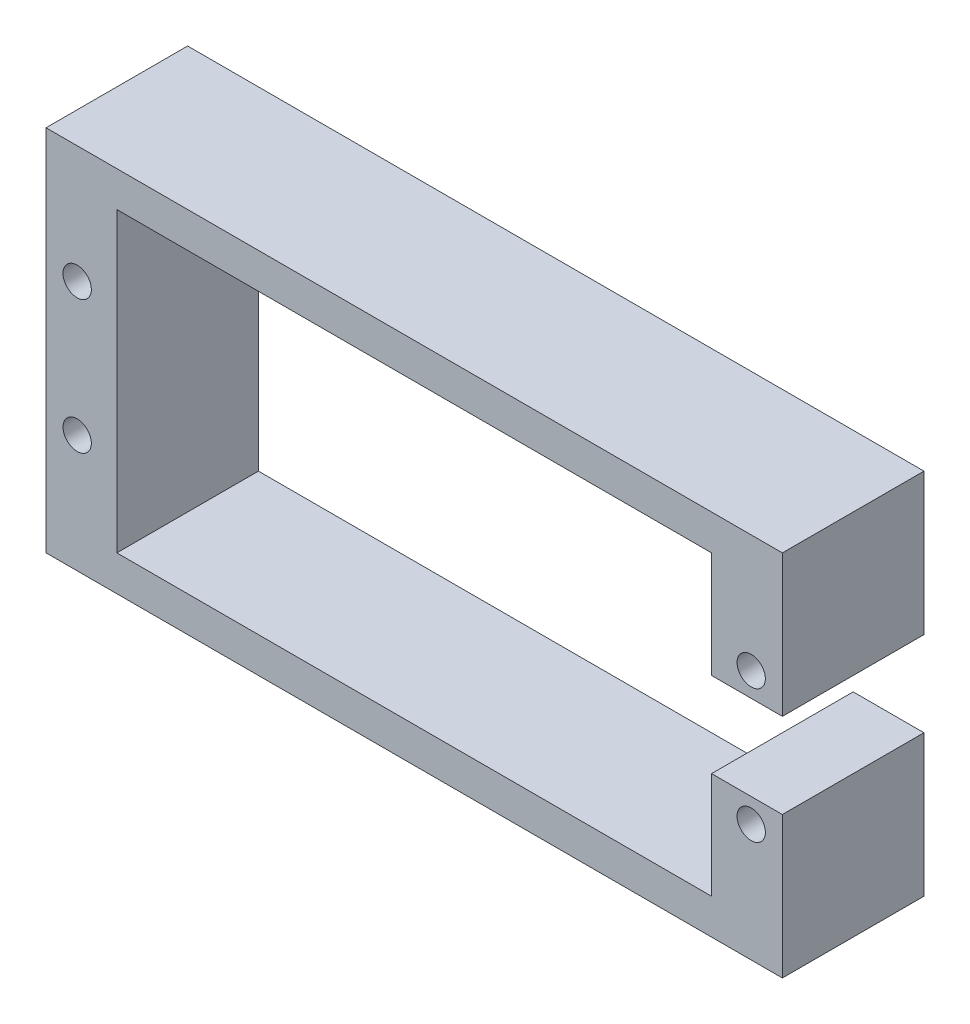
ISO-10303-21;
HEADER;
FILE_DESCRIPTION(('STEP AP214'),'2;1');
FILE_NAME('part.step','',(''),(''),'','','');
FILE_SCHEMA(('AUTOMOTIVE_DESIGN { 1 0 10303 214 1 1 1 1 }'));
ENDSEC;
DATA;
#1=APPLICATION_CONTEXT('core data for automotive mechanical design processes');
#2=APPLICATION_PROTOCOL_DEFINITION('international standard','automotive_design',2000,#1);
#3=PRODUCT_CONTEXT('',#1,'mechanical');
#4=PRODUCT('Part','Part','',(#3));
#5=PRODUCT_RELATED_PRODUCT_CATEGORY('part','',(#4));
#6=PRODUCT_DEFINITION_FORMATION('','',#4);
#7=PRODUCT_DEFINITION_CONTEXT('part definition',#1,'design');
#8=PRODUCT_DEFINITION('design','',#6,#7);
#9=PRODUCT_DEFINITION_SHAPE('','',#8);
#10=(LENGTH_UNIT() NAMED_UNIT(*) SI_UNIT(.MILLI.,.METRE.));
#11=(NAMED_UNIT(*) PLANE_ANGLE_UNIT() SI_UNIT($,.RADIAN.));
#12=(NAMED_UNIT(*) SI_UNIT($,.STERADIAN.) SOLID_ANGLE_UNIT());
#13=UNCERTAINTY_MEASURE_WITH_UNIT(LENGTH_MEASURE(1.E-05),#10,'distance_accuracy_value','');
#14=(GEOMETRIC_REPRESENTATION_CONTEXT(3) GLOBAL_UNCERTAINTY_ASSIGNED_CONTEXT((#13)) GLOBAL_UNIT_ASSIGNED_CONTEXT((#10,
#11,#12)) REPRESENTATION_CONTEXT('',''));
#15=CARTESIAN_POINT('',(0.,0.,0.));
#16=DIRECTION('',(0.,0.,1.));
#17=DIRECTION('',(1.,0.,0.));
#18=AXIS2_PLACEMENT_3D('',#15,#16,#17);
#19=CARTESIAN_POINT('',(0.,0.,10.));
#20=DIRECTION('',(0.,0.,1.));
#21=DIRECTION('',(1.,0.,0.));
#22=AXIS2_PLACEMENT_3D('',#19,#20,#21);
#23=PLANE('',#22);
#24=CARTESIAN_POINT('',(23.8,-4.7,10.));
#25=DIRECTION('',(0.,0.,1.));
#26=DIRECTION('',(1.,0.,0.));
#27=AXIS2_PLACEMENT_3D('',#24,#25,#26);
#28=CIRCLE('',#27,1.);
#29=CARTESIAN_POINT('',(24.8,-4.7,10.));
#30=VERTEX_POINT('',#29);
#31=EDGE_CURVE('E332',#30,#30,#28,.T.);
#32=ORIENTED_EDGE('',*,*,#31,.F.);
#33=EDGE_LOOP('',(#32));
#34=FACE_BOUND('',#33,.T.);
#35=CARTESIAN_POINT('',(-23.8,4.7,10.));
#36=DIRECTION('',(0.,0.,1.));
#37=DIRECTION('',(1.,0.,0.));
#38=AXIS2_PLACEMENT_3D('',#35,#36,#37);
#39=CIRCLE('',#38,1.);
#40=CARTESIAN_POINT('',(-22.8,4.7,10.));
#41=VERTEX_POINT('',#40);
#42=EDGE_CURVE('E170',#41,#41,#39,.T.);
#43=ORIENTED_EDGE('',*,*,#42,.F.);
#44=EDGE_LOOP('',(#43));
#45=FACE_BOUND('',#44,.T.);
#46=DIRECTION('',(0.,1.,0.));
#47=VECTOR('',#46,1.);
#48=CARTESIAN_POINT('',(-21.,10.5,10.));
#49=LINE('',#48,#47);
#50=CARTESIAN_POINT('',(-21.,-10.5,10.));
#51=VERTEX_POINT('',#50);
#52=CARTESIAN_POINT('',(-21.,10.5,10.));
#53=VERTEX_POINT('',#52);
#54=EDGE_CURVE('E200',#51,#53,#49,.T.);
#55=ORIENTED_EDGE('',*,*,#54,.T.);
#56=DIRECTION('',(1.,0.,0.));
#57=VECTOR('',#56,1.);
#58=CARTESIAN_POINT('',(-21.,10.5,10.));
#59=LINE('',#58,#57);
#60=CARTESIAN_POINT('',(21.,10.5,10.));
#61=VERTEX_POINT('',#60);
#62=EDGE_CURVE('E112',#53,#61,#59,.T.);
#63=ORIENTED_EDGE('',*,*,#62,.T.);
#64=DIRECTION('',(0.,-1.,0.));
#65=VECTOR('',#64,1.);
#66=CARTESIAN_POINT('',(21.,10.5,10.));
#67=LINE('',#66,#65);
#68=CARTESIAN_POINT('',(21.,3.,10.));
#69=VERTEX_POINT('',#68);
#70=EDGE_CURVE('E237',#61,#69,#67,.T.);
#71=ORIENTED_EDGE('',*,*,#70,.T.);
#72=DIRECTION('',(1.,0.,0.));
#73=VECTOR('',#72,1.);
#74=CARTESIAN_POINT('',(21.,3.,10.));
#75=LINE('',#74,#73);
#76=CARTESIAN_POINT('',(26.,3.,10.));
#77=VERTEX_POINT('',#76);
#78=EDGE_CURVE('E257',#69,#77,#75,.T.);
#79=ORIENTED_EDGE('',*,*,#78,.T.);
#80=DIRECTION('',(0.,1.,0.));
#81=VECTOR('',#80,1.);
#82=CARTESIAN_POINT('',(26.,13.,10.));
#83=LINE('',#82,#81);
#84=CARTESIAN_POINT('',(26.,13.,10.));
#85=VERTEX_POINT('',#84);
#86=EDGE_CURVE('E253',#77,#85,#83,.T.);
#87=ORIENTED_EDGE('',*,*,#86,.T.);
#88=DIRECTION('',(-1.,0.,0.));
#89=VECTOR('',#88,1.);
#90=CARTESIAN_POINT('',(-26.,13.,10.));
#91=LINE('',#90,#89);
#92=CARTESIAN_POINT('',(-26.,13.,10.));
#93=VERTEX_POINT('',#92);
#94=EDGE_CURVE('E256',#85,#93,#91,.T.);
#95=ORIENTED_EDGE('',*,*,#94,.T.);
#96=DIRECTION('',(0.,-1.,0.));
#97=VECTOR('',#96,1.);
#98=CARTESIAN_POINT('',(-26.,13.,10.));
#99=LINE('',#98,#97);
#100=CARTESIAN_POINT('',(-26.,-13.,10.));
#101=VERTEX_POINT('',#100);
#102=EDGE_CURVE('E261',#93,#101,#99,.T.);
#103=ORIENTED_EDGE('',*,*,#102,.T.);
#104=DIRECTION('',(1.,0.,0.));
#105=VECTOR('',#104,1.);
#106=CARTESIAN_POINT('',(-26.,-13.,10.));
#107=LINE('',#106,#105);
#108=CARTESIAN_POINT('',(26.,-13.,10.));
#109=VERTEX_POINT('',#108);
#110=EDGE_CURVE('E268',#101,#109,#107,.T.);
#111=ORIENTED_EDGE('',*,*,#110,.T.);
#112=DIRECTION('',(0.,1.,0.));
#113=VECTOR('',#112,1.);
#114=CARTESIAN_POINT('',(26.,-3.,10.));
#115=LINE('',#114,#113);
#116=CARTESIAN_POINT('',(26.,-3.,10.));
#117=VERTEX_POINT('',#116);
#118=EDGE_CURVE('E143',#109,#117,#115,.T.);
#119=ORIENTED_EDGE('',*,*,#118,.T.);
#120=DIRECTION('',(-1.,0.,0.));
#121=VECTOR('',#120,1.);
#122=CARTESIAN_POINT('',(21.,-3.,10.));
#123=LINE('',#122,#121);
#124=CARTESIAN_POINT('',(21.,-3.,10.));
#125=VERTEX_POINT('',#124);
#126=EDGE_CURVE('E137',#117,#125,#123,.T.);
#127=ORIENTED_EDGE('',*,*,#126,.T.);
#128=DIRECTION('',(0.,-1.,0.));
#129=VECTOR('',#128,1.);
#130=CARTESIAN_POINT('',(21.,-3.,10.));
#131=LINE('',#130,#129);
#132=CARTESIAN_POINT('',(21.,-10.5,10.));
#133=VERTEX_POINT('',#132);
#134=EDGE_CURVE('E141',#125,#133,#131,.T.);
#135=ORIENTED_EDGE('',*,*,#134,.T.);
#136=DIRECTION('',(-1.,0.,0.));
#137=VECTOR('',#136,1.);
#138=CARTESIAN_POINT('',(-21.,-10.5,10.));
#139=LINE('',#138,#137);
#140=EDGE_CURVE('E57',#133,#51,#139,.T.);
#141=ORIENTED_EDGE('',*,*,#140,.T.);
#142=EDGE_LOOP('',(#55,#63,#71,#79,#87,#95,#103,#111,#119,#127,#135,#141));
#143=FACE_BOUND('',#142,.T.);
#144=CARTESIAN_POINT('',(23.8,4.7,10.));
#145=DIRECTION('',(0.,0.,1.));
#146=DIRECTION('',(-1.,0.,0.));
#147=AXIS2_PLACEMENT_3D('',#144,#145,#146);
#148=CIRCLE('',#147,1.);
#149=CARTESIAN_POINT('',(22.8,4.7,10.));
#150=VERTEX_POINT('',#149);
#151=EDGE_CURVE('E340',#150,#150,#148,.T.);
#152=ORIENTED_EDGE('',*,*,#151,.F.);
#153=EDGE_LOOP('',(#152));
#154=FACE_BOUND('',#153,.T.);
#155=CARTESIAN_POINT('',(-23.8,-4.7,10.));
#156=DIRECTION('',(0.,0.,1.));
#157=DIRECTION('',(-1.,0.,0.));
#158=AXIS2_PLACEMENT_3D('',#155,#156,#157);
#159=CIRCLE('',#158,1.);
#160=CARTESIAN_POINT('',(-24.8,-4.7,10.));
#161=VERTEX_POINT('',#160);
#162=EDGE_CURVE('E321',#161,#161,#159,.T.);
#163=ORIENTED_EDGE('',*,*,#162,.F.);
#164=EDGE_LOOP('',(#163));
#165=FACE_BOUND('',#164,.T.);
#166=ADVANCED_FACE('F39',(#34,#45,#143,#154,#165),#23,.T.);
#167=CARTESIAN_POINT('',(0.,0.,0.));
#168=DIRECTION('',(0.,0.,1.));
#169=DIRECTION('',(1.,0.,0.));
#170=AXIS2_PLACEMENT_3D('',#167,#168,#169);
#171=PLANE('',#170);
#172=DIRECTION('',(0.,1.,0.));
#173=VECTOR('',#172,1.);
#174=CARTESIAN_POINT('',(-21.,10.5,0.));
#175=LINE('',#174,#173);
#176=CARTESIAN_POINT('',(-21.,-10.5,0.));
#177=VERTEX_POINT('',#176);
#178=CARTESIAN_POINT('',(-21.,10.5,0.));
#179=VERTEX_POINT('',#178);
#180=EDGE_CURVE('E165',#177,#179,#175,.T.);
#181=ORIENTED_EDGE('',*,*,#180,.F.);
#182=DIRECTION('',(-1.,0.,0.));
#183=VECTOR('',#182,1.);
#184=CARTESIAN_POINT('',(-21.,-10.5,0.));
#185=LINE('',#184,#183);
#186=CARTESIAN_POINT('',(21.,-10.5,0.));
#187=VERTEX_POINT('',#186);
#188=EDGE_CURVE('E104',#187,#177,#185,.T.);
#189=ORIENTED_EDGE('',*,*,#188,.F.);
#190=DIRECTION('',(0.,-1.,0.));
#191=VECTOR('',#190,1.);
#192=CARTESIAN_POINT('',(21.,-3.,0.));
#193=LINE('',#192,#191);
#194=CARTESIAN_POINT('',(21.,-3.,0.));
#195=VERTEX_POINT('',#194);
#196=EDGE_CURVE('E98',#195,#187,#193,.T.);
#197=ORIENTED_EDGE('',*,*,#196,.F.);
#198=DIRECTION('',(-1.,0.,0.));
#199=VECTOR('',#198,1.);
#200=CARTESIAN_POINT('',(21.,-3.,0.));
#201=LINE('',#200,#199);
#202=CARTESIAN_POINT('',(26.,-3.,0.));
#203=VERTEX_POINT('',#202);
#204=EDGE_CURVE('E152',#203,#195,#201,.T.);
#205=ORIENTED_EDGE('',*,*,#204,.F.);
#206=DIRECTION('',(0.,1.,0.));
#207=VECTOR('',#206,1.);
#208=CARTESIAN_POINT('',(26.,-3.,0.));
#209=LINE('',#208,#207);
#210=CARTESIAN_POINT('',(26.,-13.,0.));
#211=VERTEX_POINT('',#210);
#212=EDGE_CURVE('E191',#211,#203,#209,.T.);
#213=ORIENTED_EDGE('',*,*,#212,.F.);
#214=DIRECTION('',(1.,0.,0.));
#215=VECTOR('',#214,1.);
#216=CARTESIAN_POINT('',(-26.,-13.,0.));
#217=LINE('',#216,#215);
#218=CARTESIAN_POINT('',(-26.,-13.,0.));
#219=VERTEX_POINT('',#218);
#220=EDGE_CURVE('E188',#219,#211,#217,.T.);
#221=ORIENTED_EDGE('',*,*,#220,.F.);
#222=DIRECTION('',(0.,-1.,0.));
#223=VECTOR('',#222,1.);
#224=CARTESIAN_POINT('',(-26.,13.,0.));
#225=LINE('',#224,#223);
#226=CARTESIAN_POINT('',(-26.,13.,0.));
#227=VERTEX_POINT('',#226);
#228=EDGE_CURVE('E185',#227,#219,#225,.T.);
#229=ORIENTED_EDGE('',*,*,#228,.F.);
#230=DIRECTION('',(-1.,0.,0.));
#231=VECTOR('',#230,1.);
#232=CARTESIAN_POINT('',(-26.,13.,0.));
#233=LINE('',#232,#231);
#234=CARTESIAN_POINT('',(26.,13.,0.));
#235=VERTEX_POINT('',#234);
#236=EDGE_CURVE('E182',#235,#227,#233,.T.);
#237=ORIENTED_EDGE('',*,*,#236,.F.);
#238=DIRECTION('',(0.,1.,0.));
#239=VECTOR('',#238,1.);
#240=CARTESIAN_POINT('',(26.,13.,0.));
#241=LINE('',#240,#239);
#242=CARTESIAN_POINT('',(26.,3.,0.));
#243=VERTEX_POINT('',#242);
#244=EDGE_CURVE('E179',#243,#235,#241,.T.);
#245=ORIENTED_EDGE('',*,*,#244,.F.);
#246=DIRECTION('',(1.,0.,0.));
#247=VECTOR('',#246,1.);
#248=CARTESIAN_POINT('',(21.,3.,0.));
#249=LINE('',#248,#247);
#250=CARTESIAN_POINT('',(21.,3.,0.));
#251=VERTEX_POINT('',#250);
#252=EDGE_CURVE('E176',#251,#243,#249,.T.);
#253=ORIENTED_EDGE('',*,*,#252,.F.);
#254=DIRECTION('',(0.,-1.,0.));
#255=VECTOR('',#254,1.);
#256=CARTESIAN_POINT('',(21.,10.5,0.));
#257=LINE('',#256,#255);
#258=CARTESIAN_POINT('',(21.,10.5,0.));
#259=VERTEX_POINT('',#258);
#260=EDGE_CURVE('E173',#259,#251,#257,.T.);
#261=ORIENTED_EDGE('',*,*,#260,.F.);
#262=DIRECTION('',(1.,0.,0.));
#263=VECTOR('',#262,1.);
#264=CARTESIAN_POINT('',(-21.,10.5,0.));
#265=LINE('',#264,#263);
#266=EDGE_CURVE('E169',#179,#259,#265,.T.);
#267=ORIENTED_EDGE('',*,*,#266,.F.);
#268=EDGE_LOOP('',(#181,#189,#197,#205,#213,#221,#229,#237,#245,#253,#261,#267));
#269=FACE_BOUND('',#268,.T.);
#270=CARTESIAN_POINT('',(-23.8,4.7,0.));
#271=DIRECTION('',(0.,0.,1.));
#272=DIRECTION('',(1.,0.,0.));
#273=AXIS2_PLACEMENT_3D('',#270,#271,#272);
#274=CIRCLE('',#273,1.);
#275=CARTESIAN_POINT('',(-22.8,4.7,0.));
#276=VERTEX_POINT('',#275);
#277=EDGE_CURVE('E344',#276,#276,#274,.T.);
#278=ORIENTED_EDGE('',*,*,#277,.T.);
#279=EDGE_LOOP('',(#278));
#280=FACE_BOUND('',#279,.T.);
#281=CARTESIAN_POINT('',(23.8,4.7,0.));
#282=DIRECTION('',(0.,0.,1.));
#283=DIRECTION('',(-1.,0.,0.));
#284=AXIS2_PLACEMENT_3D('',#281,#282,#283);
#285=CIRCLE('',#284,1.);
#286=CARTESIAN_POINT('',(22.8,4.7,0.));
#287=VERTEX_POINT('',#286);
#288=EDGE_CURVE('E336',#287,#287,#285,.T.);
#289=ORIENTED_EDGE('',*,*,#288,.T.);
#290=EDGE_LOOP('',(#289));
#291=FACE_BOUND('',#290,.T.);
#292=CARTESIAN_POINT('',(23.8,-4.7,0.));
#293=DIRECTION('',(0.,0.,1.));
#294=DIRECTION('',(1.,0.,0.));
#295=AXIS2_PLACEMENT_3D('',#292,#293,#294);
#296=CIRCLE('',#295,1.);
#297=CARTESIAN_POINT('',(24.8,-4.7,0.));
#298=VERTEX_POINT('',#297);
#299=EDGE_CURVE('E329',#298,#298,#296,.T.);
#300=ORIENTED_EDGE('',*,*,#299,.T.);
#301=EDGE_LOOP('',(#300));
#302=FACE_BOUND('',#301,.T.);
#303=CARTESIAN_POINT('',(-23.8,-4.7,0.));
#304=DIRECTION('',(0.,0.,1.));
#305=DIRECTION('',(-1.,0.,0.));
#306=AXIS2_PLACEMENT_3D('',#303,#304,#305);
#307=CIRCLE('',#306,1.);
#308=CARTESIAN_POINT('',(-24.8,-4.7,0.));
#309=VERTEX_POINT('',#308);
#310=EDGE_CURVE('E324',#309,#309,#307,.T.);
#311=ORIENTED_EDGE('',*,*,#310,.T.);
#312=EDGE_LOOP('',(#311));
#313=FACE_BOUND('',#312,.T.);
#314=ADVANCED_FACE('F241',(#269,#280,#291,#302,#313),#171,.F.);
#315=CARTESIAN_POINT('',(-21.,10.5,10.));
#316=DIRECTION('',(-1.,0.,0.));
#317=DIRECTION('',(0.,-1.,0.));
#318=AXIS2_PLACEMENT_3D('',#315,#316,#317);
#319=PLANE('',#318);
#320=ORIENTED_EDGE('',*,*,#180,.T.);
#321=DIRECTION('',(0.,0.,-1.));
#322=VECTOR('',#321,1.);
#323=CARTESIAN_POINT('',(-21.,10.5,10.));
#324=LINE('',#323,#322);
#325=EDGE_CURVE('E11',#53,#179,#324,.T.);
#326=ORIENTED_EDGE('',*,*,#325,.F.);
#327=ORIENTED_EDGE('',*,*,#54,.F.);
#328=DIRECTION('',(0.,0.,-1.));
#329=VECTOR('',#328,1.);
#330=CARTESIAN_POINT('',(-21.,-10.5,10.));
#331=LINE('',#330,#329);
#332=EDGE_CURVE('E161',#51,#177,#331,.T.);
#333=ORIENTED_EDGE('',*,*,#332,.T.);
#334=EDGE_LOOP('',(#320,#326,#327,#333));
#335=FACE_BOUND('',#334,.T.);
#336=ADVANCED_FACE('F41',(#335),#319,.F.);
#337=CARTESIAN_POINT('',(-21.,10.5,10.));
#338=DIRECTION('',(0.,1.,0.));
#339=DIRECTION('',(-1.,0.,0.));
#340=AXIS2_PLACEMENT_3D('',#337,#338,#339);
#341=PLANE('',#340);
#342=ORIENTED_EDGE('',*,*,#266,.T.);
#343=DIRECTION('',(0.,0.,-1.));
#344=VECTOR('',#343,1.);
#345=CARTESIAN_POINT('',(21.,10.5,10.));
#346=LINE('',#345,#344);
#347=EDGE_CURVE('E49',#61,#259,#346,.T.);
#348=ORIENTED_EDGE('',*,*,#347,.F.);
#349=ORIENTED_EDGE('',*,*,#62,.F.);
#350=ORIENTED_EDGE('',*,*,#325,.T.);
#351=EDGE_LOOP('',(#342,#348,#349,#350));
#352=FACE_BOUND('',#351,.T.);
#353=ADVANCED_FACE('F460',(#352),#341,.F.);
#354=CARTESIAN_POINT('',(21.,10.5,10.));
#355=DIRECTION('',(1.,0.,0.));
#356=DIRECTION('',(0.,0.,-1.));
#357=AXIS2_PLACEMENT_3D('',#354,#355,#356);
#358=PLANE('',#357);
#359=ORIENTED_EDGE('',*,*,#260,.T.);
#360=DIRECTION('',(0.,0.,-1.));
#361=VECTOR('',#360,1.);
#362=CARTESIAN_POINT('',(21.,3.,10.));
#363=LINE('',#362,#361);
#364=EDGE_CURVE('E227',#69,#251,#363,.T.);
#365=ORIENTED_EDGE('',*,*,#364,.F.);
#366=ORIENTED_EDGE('',*,*,#70,.F.);
#367=ORIENTED_EDGE('',*,*,#347,.T.);
#368=EDGE_LOOP('',(#359,#365,#366,#367));
#369=FACE_BOUND('',#368,.T.);
#370=ADVANCED_FACE('F235',(#369),#358,.F.);
#371=CARTESIAN_POINT('',(21.,3.,10.));
#372=DIRECTION('',(0.,1.,0.));
#373=DIRECTION('',(-1.,0.,0.));
#374=AXIS2_PLACEMENT_3D('',#371,#372,#373);
#375=PLANE('',#374);
#376=ORIENTED_EDGE('',*,*,#252,.T.);
#377=DIRECTION('',(0.,0.,-1.));
#378=VECTOR('',#377,1.);
#379=CARTESIAN_POINT('',(26.,3.,10.));
#380=LINE('',#379,#378);
#381=EDGE_CURVE('E223',#77,#243,#380,.T.);
#382=ORIENTED_EDGE('',*,*,#381,.F.);
#383=ORIENTED_EDGE('',*,*,#78,.F.);
#384=ORIENTED_EDGE('',*,*,#364,.T.);
#385=EDGE_LOOP('',(#376,#382,#383,#384));
#386=FACE_BOUND('',#385,.T.);
#387=ADVANCED_FACE('F247',(#386),#375,.F.);
#388=CARTESIAN_POINT('',(26.,13.,10.));
#389=DIRECTION('',(-1.,0.,0.));
#390=DIRECTION('',(0.,-1.,0.));
#391=AXIS2_PLACEMENT_3D('',#388,#389,#390);
#392=PLANE('',#391);
#393=ORIENTED_EDGE('',*,*,#244,.T.);
#394=DIRECTION('',(0.,0.,-1.));
#395=VECTOR('',#394,1.);
#396=CARTESIAN_POINT('',(26.,13.,10.));
#397=LINE('',#396,#395);
#398=EDGE_CURVE('E219',#85,#235,#397,.T.);
#399=ORIENTED_EDGE('',*,*,#398,.F.);
#400=ORIENTED_EDGE('',*,*,#86,.F.);
#401=ORIENTED_EDGE('',*,*,#381,.T.);
#402=EDGE_LOOP('',(#393,#399,#400,#401));
#403=FACE_BOUND('',#402,.T.);
#404=ADVANCED_FACE('F251',(#403),#392,.F.);
#405=CARTESIAN_POINT('',(-26.,13.,10.));
#406=DIRECTION('',(0.,-1.,0.));
#407=DIRECTION('',(0.,0.,-1.));
#408=AXIS2_PLACEMENT_3D('',#405,#406,#407);
#409=PLANE('',#408);
#410=ORIENTED_EDGE('',*,*,#236,.T.);
#411=DIRECTION('',(0.,0.,-1.));
#412=VECTOR('',#411,1.);
#413=CARTESIAN_POINT('',(-26.,13.,10.));
#414=LINE('',#413,#412);
#415=EDGE_CURVE('E215',#93,#227,#414,.T.);
#416=ORIENTED_EDGE('',*,*,#415,.F.);
#417=ORIENTED_EDGE('',*,*,#94,.F.);
#418=ORIENTED_EDGE('',*,*,#398,.T.);
#419=EDGE_LOOP('',(#410,#416,#417,#418));
#420=FACE_BOUND('',#419,.T.);
#421=ADVANCED_FACE('F425',(#420),#409,.F.);
#422=CARTESIAN_POINT('',(-26.,13.,10.));
#423=DIRECTION('',(1.,0.,0.));
#424=DIRECTION('',(0.,0.,-1.));
#425=AXIS2_PLACEMENT_3D('',#422,#423,#424);
#426=PLANE('',#425);
#427=ORIENTED_EDGE('',*,*,#228,.T.);
#428=DIRECTION('',(0.,0.,-1.));
#429=VECTOR('',#428,1.);
#430=CARTESIAN_POINT('',(-26.,-13.,10.));
#431=LINE('',#430,#429);
#432=EDGE_CURVE('E211',#101,#219,#431,.T.);
#433=ORIENTED_EDGE('',*,*,#432,.F.);
#434=ORIENTED_EDGE('',*,*,#102,.F.);
#435=ORIENTED_EDGE('',*,*,#415,.T.);
#436=EDGE_LOOP('',(#427,#433,#434,#435));
#437=FACE_BOUND('',#436,.T.);
#438=ADVANCED_FACE('F416',(#437),#426,.F.);
#439=CARTESIAN_POINT('',(-26.,-13.,10.));
#440=DIRECTION('',(0.,1.,0.));
#441=DIRECTION('',(0.,0.,1.));
#442=AXIS2_PLACEMENT_3D('',#439,#440,#441);
#443=PLANE('',#442);
#444=ORIENTED_EDGE('',*,*,#220,.T.);
#445=DIRECTION('',(0.,0.,-1.));
#446=VECTOR('',#445,1.);
#447=CARTESIAN_POINT('',(26.,-13.,10.));
#448=LINE('',#447,#446);
#449=EDGE_CURVE('E207',#109,#211,#448,.T.);
#450=ORIENTED_EDGE('',*,*,#449,.F.);
#451=ORIENTED_EDGE('',*,*,#110,.F.);
#452=ORIENTED_EDGE('',*,*,#432,.T.);
#453=EDGE_LOOP('',(#444,#450,#451,#452));
#454=FACE_BOUND('',#453,.T.);
#455=ADVANCED_FACE('F276',(#454),#443,.F.);
#456=CARTESIAN_POINT('',(26.,-3.,10.));
#457=DIRECTION('',(-1.,0.,0.));
#458=DIRECTION('',(0.,-1.,0.));
#459=AXIS2_PLACEMENT_3D('',#456,#457,#458);
#460=PLANE('',#459);
#461=ORIENTED_EDGE('',*,*,#212,.T.);
#462=DIRECTION('',(0.,0.,-1.));
#463=VECTOR('',#462,1.);
#464=CARTESIAN_POINT('',(26.,-3.,10.));
#465=LINE('',#464,#463);
#466=EDGE_CURVE('E154',#117,#203,#465,.T.);
#467=ORIENTED_EDGE('',*,*,#466,.F.);
#468=ORIENTED_EDGE('',*,*,#118,.F.);
#469=ORIENTED_EDGE('',*,*,#449,.T.);
#470=EDGE_LOOP('',(#461,#467,#468,#469));
#471=FACE_BOUND('',#470,.T.);
#472=ADVANCED_FACE('F280',(#471),#460,.F.);
#473=CARTESIAN_POINT('',(21.,-3.,10.));
#474=DIRECTION('',(0.,-1.,0.));
#475=DIRECTION('',(0.,0.,-1.));
#476=AXIS2_PLACEMENT_3D('',#473,#474,#475);
#477=PLANE('',#476);
#478=ORIENTED_EDGE('',*,*,#204,.T.);
#479=DIRECTION('',(0.,0.,-1.));
#480=VECTOR('',#479,1.);
#481=CARTESIAN_POINT('',(21.,-3.,10.));
#482=LINE('',#481,#480);
#483=EDGE_CURVE('E149',#125,#195,#482,.T.);
#484=ORIENTED_EDGE('',*,*,#483,.F.);
#485=ORIENTED_EDGE('',*,*,#126,.F.);
#486=ORIENTED_EDGE('',*,*,#466,.T.);
#487=EDGE_LOOP('',(#478,#484,#485,#486));
#488=FACE_BOUND('',#487,.T.);
#489=ADVANCED_FACE('F150',(#488),#477,.F.);
#490=CARTESIAN_POINT('',(21.,-3.,10.));
#491=DIRECTION('',(1.,0.,0.));
#492=DIRECTION('',(0.,1.,0.));
#493=AXIS2_PLACEMENT_3D('',#490,#491,#492);
#494=PLANE('',#493);
#495=ORIENTED_EDGE('',*,*,#196,.T.);
#496=DIRECTION('',(0.,0.,-1.));
#497=VECTOR('',#496,1.);
#498=CARTESIAN_POINT('',(21.,-10.5,10.));
#499=LINE('',#498,#497);
#500=EDGE_CURVE('E155',#133,#187,#499,.T.);
#501=ORIENTED_EDGE('',*,*,#500,.F.);
#502=ORIENTED_EDGE('',*,*,#134,.F.);
#503=ORIENTED_EDGE('',*,*,#483,.T.);
#504=EDGE_LOOP('',(#495,#501,#502,#503));
#505=FACE_BOUND('',#504,.T.);
#506=ADVANCED_FACE('F157',(#505),#494,.F.);
#507=CARTESIAN_POINT('',(-21.,-10.5,10.));
#508=DIRECTION('',(0.,-1.,0.));
#509=DIRECTION('',(0.,0.,-1.));
#510=AXIS2_PLACEMENT_3D('',#507,#508,#509);
#511=PLANE('',#510);
#512=ORIENTED_EDGE('',*,*,#188,.T.);
#513=ORIENTED_EDGE('',*,*,#332,.F.);
#514=ORIENTED_EDGE('',*,*,#140,.F.);
#515=ORIENTED_EDGE('',*,*,#500,.T.);
#516=EDGE_LOOP('',(#512,#513,#514,#515));
#517=FACE_BOUND('',#516,.T.);
#518=ADVANCED_FACE('F284',(#517),#511,.F.);
#519=CARTESIAN_POINT('',(-23.8,4.7,10.));
#520=DIRECTION('',(0.,0.,-1.));
#521=DIRECTION('',(-1.,0.,0.));
#522=AXIS2_PLACEMENT_3D('',#519,#520,#521);
#523=CYLINDRICAL_SURFACE('',#522,1.);
#524=ORIENTED_EDGE('',*,*,#42,.T.);
#525=EDGE_LOOP('',(#524));
#526=FACE_BOUND('',#525,.T.);
#527=ORIENTED_EDGE('',*,*,#277,.F.);
#528=EDGE_LOOP('',(#527));
#529=FACE_BOUND('',#528,.T.);
#530=ADVANCED_FACE('F286',(#526,#529),#523,.F.);
#531=CARTESIAN_POINT('',(23.8,4.7,10.));
#532=DIRECTION('',(0.,0.,-1.));
#533=DIRECTION('',(-1.,0.,0.));
#534=AXIS2_PLACEMENT_3D('',#531,#532,#533);
#535=CYLINDRICAL_SURFACE('',#534,1.);
#536=ORIENTED_EDGE('',*,*,#151,.T.);
#537=EDGE_LOOP('',(#536));
#538=FACE_BOUND('',#537,.T.);
#539=ORIENTED_EDGE('',*,*,#288,.F.);
#540=EDGE_LOOP('',(#539));
#541=FACE_BOUND('',#540,.T.);
#542=ADVANCED_FACE('F292',(#538,#541),#535,.F.);
#543=CARTESIAN_POINT('',(23.8,-4.7,10.));
#544=DIRECTION('',(0.,0.,-1.));
#545=DIRECTION('',(-1.,0.,0.));
#546=AXIS2_PLACEMENT_3D('',#543,#544,#545);
#547=CYLINDRICAL_SURFACE('',#546,1.);
#548=ORIENTED_EDGE('',*,*,#31,.T.);
#549=EDGE_LOOP('',(#548));
#550=FACE_BOUND('',#549,.T.);
#551=ORIENTED_EDGE('',*,*,#299,.F.);
#552=EDGE_LOOP('',(#551));
#553=FACE_BOUND('',#552,.T.);
#554=ADVANCED_FACE('F308',(#550,#553),#547,.F.);
#555=CARTESIAN_POINT('',(-23.8,-4.7,10.));
#556=DIRECTION('',(0.,0.,-1.));
#557=DIRECTION('',(-1.,0.,0.));
#558=AXIS2_PLACEMENT_3D('',#555,#556,#557);
#559=CYLINDRICAL_SURFACE('',#558,1.);
#560=ORIENTED_EDGE('',*,*,#162,.T.);
#561=EDGE_LOOP('',(#560));
#562=FACE_BOUND('',#561,.T.);
#563=ORIENTED_EDGE('',*,*,#310,.F.);
#564=EDGE_LOOP('',(#563));
#565=FACE_BOUND('',#564,.T.);
#566=ADVANCED_FACE('F312',(#562,#565),#559,.F.);
#567=CLOSED_SHELL('',(#166,#314,#336,#353,#370,#387,#404,#421,#438,#455,#472,#489,#506,#518,
#530,#542,#554,#566));
#568=MANIFOLD_SOLID_BREP('B2',#567);
#569=ADVANCED_BREP_SHAPE_REPRESENTATION('',(#18,#568),#14);
#570=SHAPE_DEFINITION_REPRESENTATION(#9,#569);
ENDSEC;
END-ISO-10303-21;
